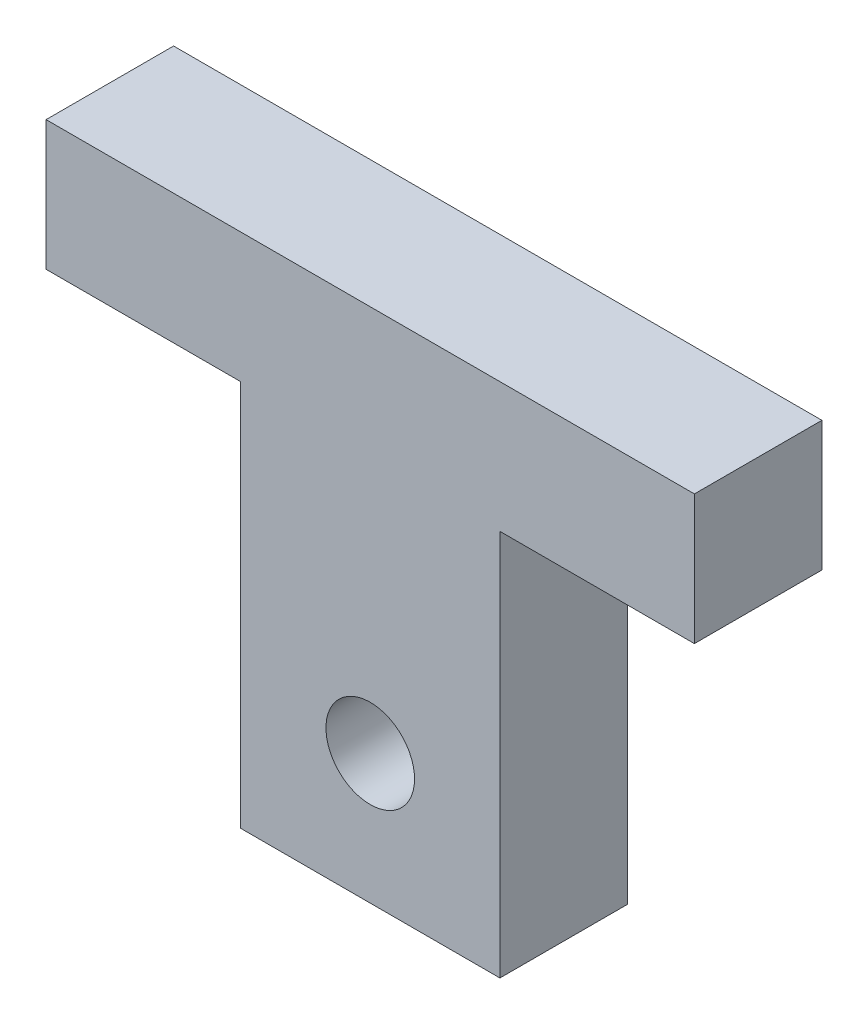
ISO-10303-21;
HEADER;
FILE_DESCRIPTION(('STEP AP214'),'2;1');
FILE_NAME('part.step','',(''),(''),'','','');
FILE_SCHEMA(('AUTOMOTIVE_DESIGN { 1 0 10303 214 1 1 1 1 }'));
ENDSEC;
DATA;
#1=APPLICATION_CONTEXT('core data for automotive mechanical design processes');
#2=APPLICATION_PROTOCOL_DEFINITION('international standard','automotive_design',2000,#1);
#3=PRODUCT_CONTEXT('',#1,'mechanical');
#4=PRODUCT('Part','Part','',(#3));
#5=PRODUCT_RELATED_PRODUCT_CATEGORY('part','',(#4));
#6=PRODUCT_DEFINITION_FORMATION('','',#4);
#7=PRODUCT_DEFINITION_CONTEXT('part definition',#1,'design');
#8=PRODUCT_DEFINITION('design','',#6,#7);
#9=PRODUCT_DEFINITION_SHAPE('','',#8);
#10=(LENGTH_UNIT() NAMED_UNIT(*) SI_UNIT(.MILLI.,.METRE.));
#11=(NAMED_UNIT(*) PLANE_ANGLE_UNIT() SI_UNIT($,.RADIAN.));
#12=(NAMED_UNIT(*) SI_UNIT($,.STERADIAN.) SOLID_ANGLE_UNIT());
#13=UNCERTAINTY_MEASURE_WITH_UNIT(LENGTH_MEASURE(1.E-05),#10,'distance_accuracy_value','');
#14=(GEOMETRIC_REPRESENTATION_CONTEXT(3) GLOBAL_UNCERTAINTY_ASSIGNED_CONTEXT((#13)) GLOBAL_UNIT_ASSIGNED_CONTEXT((#10,
#11,#12)) REPRESENTATION_CONTEXT('',''));
#15=CARTESIAN_POINT('',(0.,0.,0.));
#16=DIRECTION('',(0.,0.,1.));
#17=DIRECTION('',(1.,0.,0.));
#18=AXIS2_PLACEMENT_3D('',#15,#16,#17);
#19=CARTESIAN_POINT('',(0.,0.,5.9));
#20=DIRECTION('',(0.,0.,-1.));
#21=DIRECTION('',(-1.,0.,0.));
#22=AXIS2_PLACEMENT_3D('',#19,#20,#21);
#23=PLANE('',#22);
#24=DIRECTION('',(0.,1.,0.));
#25=VECTOR('',#24,1.);
#26=CARTESIAN_POINT('',(15.,-3.,5.9));
#27=LINE('',#26,#25);
#28=CARTESIAN_POINT('',(15.,-3.,5.9));
#29=VERTEX_POINT('',#28);
#30=CARTESIAN_POINT('',(15.,3.,5.9));
#31=VERTEX_POINT('',#30);
#32=EDGE_CURVE('E148',#29,#31,#27,.T.);
#33=ORIENTED_EDGE('',*,*,#32,.T.);
#34=DIRECTION('',(-1.,0.,0.));
#35=VECTOR('',#34,1.);
#36=CARTESIAN_POINT('',(-15.,3.,5.9));
#37=LINE('',#36,#35);
#38=CARTESIAN_POINT('',(-15.,3.,5.9));
#39=VERTEX_POINT('',#38);
#40=EDGE_CURVE('E96',#31,#39,#37,.T.);
#41=ORIENTED_EDGE('',*,*,#40,.T.);
#42=DIRECTION('',(0.,-1.,0.));
#43=VECTOR('',#42,1.);
#44=CARTESIAN_POINT('',(-15.,-3.,5.9));
#45=LINE('',#44,#43);
#46=CARTESIAN_POINT('',(-15.,-3.,5.9));
#47=VERTEX_POINT('',#46);
#48=EDGE_CURVE('E163',#39,#47,#45,.T.);
#49=ORIENTED_EDGE('',*,*,#48,.T.);
#50=DIRECTION('',(1.,0.,0.));
#51=VECTOR('',#50,1.);
#52=CARTESIAN_POINT('',(-15.,-3.,5.9));
#53=LINE('',#52,#51);
#54=CARTESIAN_POINT('',(-6.,-3.,5.9));
#55=VERTEX_POINT('',#54);
#56=EDGE_CURVE('E176',#47,#55,#53,.T.);
#57=ORIENTED_EDGE('',*,*,#56,.T.);
#58=DIRECTION('',(0.,-1.,0.));
#59=VECTOR('',#58,1.);
#60=CARTESIAN_POINT('',(-6.,-3.,5.9));
#61=LINE('',#60,#59);
#62=CARTESIAN_POINT('',(-6.,-20.9,5.9));
#63=VERTEX_POINT('',#62);
#64=EDGE_CURVE('E115',#55,#63,#61,.T.);
#65=ORIENTED_EDGE('',*,*,#64,.T.);
#66=DIRECTION('',(1.,0.,0.));
#67=VECTOR('',#66,1.);
#68=CARTESIAN_POINT('',(-6.,-20.9,5.9));
#69=LINE('',#68,#67);
#70=CARTESIAN_POINT('',(6.,-20.9,5.9));
#71=VERTEX_POINT('',#70);
#72=EDGE_CURVE('E109',#63,#71,#69,.T.);
#73=ORIENTED_EDGE('',*,*,#72,.T.);
#74=DIRECTION('',(0.,1.,0.));
#75=VECTOR('',#74,1.);
#76=CARTESIAN_POINT('',(6.,-20.9,5.9));
#77=LINE('',#76,#75);
#78=CARTESIAN_POINT('',(6.,-3.,5.9));
#79=VERTEX_POINT('',#78);
#80=EDGE_CURVE('E113',#71,#79,#77,.T.);
#81=ORIENTED_EDGE('',*,*,#80,.T.);
#82=DIRECTION('',(1.,0.,0.));
#83=VECTOR('',#82,1.);
#84=CARTESIAN_POINT('',(6.,-3.,5.9));
#85=LINE('',#84,#83);
#86=EDGE_CURVE('E53',#79,#29,#85,.T.);
#87=ORIENTED_EDGE('',*,*,#86,.T.);
#88=EDGE_LOOP('',(#33,#41,#49,#57,#65,#73,#81,#87));
#89=FACE_BOUND('',#88,.T.);
#90=CARTESIAN_POINT('',(0.,-14.9,5.9));
#91=DIRECTION('',(0.,0.,1.));
#92=DIRECTION('',(1.,0.,0.));
#93=AXIS2_PLACEMENT_3D('',#90,#91,#92);
#94=CIRCLE('',#93,2.05);
#95=CARTESIAN_POINT('',(2.05,-14.9,5.9));
#96=VERTEX_POINT('',#95);
#97=EDGE_CURVE('E137',#96,#96,#94,.T.);
#98=ORIENTED_EDGE('',*,*,#97,.F.);
#99=EDGE_LOOP('',(#98));
#100=FACE_BOUND('',#99,.T.);
#101=ADVANCED_FACE('F36',(#89,#100),#23,.F.);
#102=CARTESIAN_POINT('',(0.,0.,0.));
#103=DIRECTION('',(0.,0.,-1.));
#104=DIRECTION('',(-1.,0.,0.));
#105=AXIS2_PLACEMENT_3D('',#102,#103,#104);
#106=PLANE('',#105);
#107=DIRECTION('',(0.,1.,0.));
#108=VECTOR('',#107,1.);
#109=CARTESIAN_POINT('',(15.,-3.,0.));
#110=LINE('',#109,#108);
#111=CARTESIAN_POINT('',(15.,-3.,0.));
#112=VERTEX_POINT('',#111);
#113=CARTESIAN_POINT('',(15.,3.,0.));
#114=VERTEX_POINT('',#113);
#115=EDGE_CURVE('E133',#112,#114,#110,.T.);
#116=ORIENTED_EDGE('',*,*,#115,.F.);
#117=DIRECTION('',(1.,0.,0.));
#118=VECTOR('',#117,1.);
#119=CARTESIAN_POINT('',(6.,-3.,0.));
#120=LINE('',#119,#118);
#121=CARTESIAN_POINT('',(6.,-3.,0.));
#122=VERTEX_POINT('',#121);
#123=EDGE_CURVE('E88',#122,#112,#120,.T.);
#124=ORIENTED_EDGE('',*,*,#123,.F.);
#125=DIRECTION('',(0.,1.,0.));
#126=VECTOR('',#125,1.);
#127=CARTESIAN_POINT('',(6.,-20.9,0.));
#128=LINE('',#127,#126);
#129=CARTESIAN_POINT('',(6.,-20.9,0.));
#130=VERTEX_POINT('',#129);
#131=EDGE_CURVE('E82',#130,#122,#128,.T.);
#132=ORIENTED_EDGE('',*,*,#131,.F.);
#133=DIRECTION('',(1.,0.,0.));
#134=VECTOR('',#133,1.);
#135=CARTESIAN_POINT('',(-6.,-20.9,0.));
#136=LINE('',#135,#134);
#137=CARTESIAN_POINT('',(-6.,-20.9,0.));
#138=VERTEX_POINT('',#137);
#139=EDGE_CURVE('E123',#138,#130,#136,.T.);
#140=ORIENTED_EDGE('',*,*,#139,.F.);
#141=DIRECTION('',(0.,-1.,0.));
#142=VECTOR('',#141,1.);
#143=CARTESIAN_POINT('',(-6.,-3.,0.));
#144=LINE('',#143,#142);
#145=CARTESIAN_POINT('',(-6.,-3.,0.));
#146=VERTEX_POINT('',#145);
#147=EDGE_CURVE('E143',#146,#138,#144,.T.);
#148=ORIENTED_EDGE('',*,*,#147,.F.);
#149=DIRECTION('',(1.,0.,0.));
#150=VECTOR('',#149,1.);
#151=CARTESIAN_POINT('',(-15.,-3.,0.));
#152=LINE('',#151,#150);
#153=CARTESIAN_POINT('',(-15.,-3.,0.));
#154=VERTEX_POINT('',#153);
#155=EDGE_CURVE('E141',#154,#146,#152,.T.);
#156=ORIENTED_EDGE('',*,*,#155,.F.);
#157=DIRECTION('',(0.,-1.,0.));
#158=VECTOR('',#157,1.);
#159=CARTESIAN_POINT('',(-15.,-3.,0.));
#160=LINE('',#159,#158);
#161=CARTESIAN_POINT('',(-15.,3.,0.));
#162=VERTEX_POINT('',#161);
#163=EDGE_CURVE('E139',#162,#154,#160,.T.);
#164=ORIENTED_EDGE('',*,*,#163,.F.);
#165=DIRECTION('',(-1.,0.,0.));
#166=VECTOR('',#165,1.);
#167=CARTESIAN_POINT('',(-15.,3.,0.));
#168=LINE('',#167,#166);
#169=EDGE_CURVE('E136',#114,#162,#168,.T.);
#170=ORIENTED_EDGE('',*,*,#169,.F.);
#171=EDGE_LOOP('',(#116,#124,#132,#140,#148,#156,#164,#170));
#172=FACE_BOUND('',#171,.T.);
#173=CARTESIAN_POINT('',(0.,-14.9,0.));
#174=DIRECTION('',(0.,0.,1.));
#175=DIRECTION('',(1.,0.,0.));
#176=AXIS2_PLACEMENT_3D('',#173,#174,#175);
#177=CIRCLE('',#176,2.05);
#178=CARTESIAN_POINT('',(2.05,-14.9,0.));
#179=VERTEX_POINT('',#178);
#180=EDGE_CURVE('E182',#179,#179,#177,.T.);
#181=ORIENTED_EDGE('',*,*,#180,.T.);
#182=EDGE_LOOP('',(#181));
#183=FACE_BOUND('',#182,.T.);
#184=ADVANCED_FACE('F167',(#172,#183),#106,.T.);
#185=CARTESIAN_POINT('',(15.,-3.,5.9));
#186=DIRECTION('',(-1.,0.,0.));
#187=DIRECTION('',(0.,0.,1.));
#188=AXIS2_PLACEMENT_3D('',#185,#186,#187);
#189=PLANE('',#188);
#190=ORIENTED_EDGE('',*,*,#115,.T.);
#191=DIRECTION('',(0.,0.,-1.));
#192=VECTOR('',#191,1.);
#193=CARTESIAN_POINT('',(15.,3.,5.9));
#194=LINE('',#193,#192);
#195=EDGE_CURVE('E11',#31,#114,#194,.T.);
#196=ORIENTED_EDGE('',*,*,#195,.F.);
#197=ORIENTED_EDGE('',*,*,#32,.F.);
#198=DIRECTION('',(0.,0.,-1.));
#199=VECTOR('',#198,1.);
#200=CARTESIAN_POINT('',(15.,-3.,5.9));
#201=LINE('',#200,#199);
#202=EDGE_CURVE('E129',#29,#112,#201,.T.);
#203=ORIENTED_EDGE('',*,*,#202,.T.);
#204=EDGE_LOOP('',(#190,#196,#197,#203));
#205=FACE_BOUND('',#204,.T.);
#206=ADVANCED_FACE('F38',(#205),#189,.F.);
#207=CARTESIAN_POINT('',(-15.,3.,5.9));
#208=DIRECTION('',(0.,-1.,0.));
#209=DIRECTION('',(0.,0.,-1.));
#210=AXIS2_PLACEMENT_3D('',#207,#208,#209);
#211=PLANE('',#210);
#212=ORIENTED_EDGE('',*,*,#169,.T.);
#213=DIRECTION('',(0.,0.,-1.));
#214=VECTOR('',#213,1.);
#215=CARTESIAN_POINT('',(-15.,3.,5.9));
#216=LINE('',#215,#214);
#217=EDGE_CURVE('E45',#39,#162,#216,.T.);
#218=ORIENTED_EDGE('',*,*,#217,.F.);
#219=ORIENTED_EDGE('',*,*,#40,.F.);
#220=ORIENTED_EDGE('',*,*,#195,.T.);
#221=EDGE_LOOP('',(#212,#218,#219,#220));
#222=FACE_BOUND('',#221,.T.);
#223=ADVANCED_FACE('F210',(#222),#211,.F.);
#224=CARTESIAN_POINT('',(-15.,-3.,5.9));
#225=DIRECTION('',(1.,0.,0.));
#226=DIRECTION('',(0.,0.,-1.));
#227=AXIS2_PLACEMENT_3D('',#224,#225,#226);
#228=PLANE('',#227);
#229=ORIENTED_EDGE('',*,*,#163,.T.);
#230=DIRECTION('',(0.,0.,-1.));
#231=VECTOR('',#230,1.);
#232=CARTESIAN_POINT('',(-15.,-3.,5.9));
#233=LINE('',#232,#231);
#234=EDGE_CURVE('E155',#47,#154,#233,.T.);
#235=ORIENTED_EDGE('',*,*,#234,.F.);
#236=ORIENTED_EDGE('',*,*,#48,.F.);
#237=ORIENTED_EDGE('',*,*,#217,.T.);
#238=EDGE_LOOP('',(#229,#235,#236,#237));
#239=FACE_BOUND('',#238,.T.);
#240=ADVANCED_FACE('F161',(#239),#228,.F.);
#241=CARTESIAN_POINT('',(-15.,-3.,5.9));
#242=DIRECTION('',(0.,1.,0.));
#243=DIRECTION('',(-1.,0.,0.));
#244=AXIS2_PLACEMENT_3D('',#241,#242,#243);
#245=PLANE('',#244);
#246=ORIENTED_EDGE('',*,*,#155,.T.);
#247=DIRECTION('',(0.,0.,-1.));
#248=VECTOR('',#247,1.);
#249=CARTESIAN_POINT('',(-6.,-3.,5.9));
#250=LINE('',#249,#248);
#251=EDGE_CURVE('E152',#55,#146,#250,.T.);
#252=ORIENTED_EDGE('',*,*,#251,.F.);
#253=ORIENTED_EDGE('',*,*,#56,.F.);
#254=ORIENTED_EDGE('',*,*,#234,.T.);
#255=EDGE_LOOP('',(#246,#252,#253,#254));
#256=FACE_BOUND('',#255,.T.);
#257=ADVANCED_FACE('F172',(#256),#245,.F.);
#258=CARTESIAN_POINT('',(-6.,-3.,5.9));
#259=DIRECTION('',(1.,0.,0.));
#260=DIRECTION('',(0.,1.,0.));
#261=AXIS2_PLACEMENT_3D('',#258,#259,#260);
#262=PLANE('',#261);
#263=ORIENTED_EDGE('',*,*,#147,.T.);
#264=DIRECTION('',(0.,0.,-1.));
#265=VECTOR('',#264,1.);
#266=CARTESIAN_POINT('',(-6.,-20.9,5.9));
#267=LINE('',#266,#265);
#268=EDGE_CURVE('E124',#63,#138,#267,.T.);
#269=ORIENTED_EDGE('',*,*,#268,.F.);
#270=ORIENTED_EDGE('',*,*,#64,.F.);
#271=ORIENTED_EDGE('',*,*,#251,.T.);
#272=EDGE_LOOP('',(#263,#269,#270,#271));
#273=FACE_BOUND('',#272,.T.);
#274=ADVANCED_FACE('F175',(#273),#262,.F.);
#275=CARTESIAN_POINT('',(-6.,-20.9,5.9));
#276=DIRECTION('',(0.,1.,0.));
#277=DIRECTION('',(0.,0.,1.));
#278=AXIS2_PLACEMENT_3D('',#275,#276,#277);
#279=PLANE('',#278);
#280=ORIENTED_EDGE('',*,*,#139,.T.);
#281=DIRECTION('',(0.,0.,-1.));
#282=VECTOR('',#281,1.);
#283=CARTESIAN_POINT('',(6.,-20.9,5.9));
#284=LINE('',#283,#282);
#285=EDGE_CURVE('E120',#71,#130,#284,.T.);
#286=ORIENTED_EDGE('',*,*,#285,.F.);
#287=ORIENTED_EDGE('',*,*,#72,.F.);
#288=ORIENTED_EDGE('',*,*,#268,.T.);
#289=EDGE_LOOP('',(#280,#286,#287,#288));
#290=FACE_BOUND('',#289,.T.);
#291=ADVANCED_FACE('F121',(#290),#279,.F.);
#292=CARTESIAN_POINT('',(6.,-20.9,5.9));
#293=DIRECTION('',(-1.,0.,0.));
#294=DIRECTION('',(0.,-1.,0.));
#295=AXIS2_PLACEMENT_3D('',#292,#293,#294);
#296=PLANE('',#295);
#297=ORIENTED_EDGE('',*,*,#131,.T.);
#298=DIRECTION('',(0.,0.,-1.));
#299=VECTOR('',#298,1.);
#300=CARTESIAN_POINT('',(6.,-3.,5.9));
#301=LINE('',#300,#299);
#302=EDGE_CURVE('E125',#79,#122,#301,.T.);
#303=ORIENTED_EDGE('',*,*,#302,.F.);
#304=ORIENTED_EDGE('',*,*,#80,.F.);
#305=ORIENTED_EDGE('',*,*,#285,.T.);
#306=EDGE_LOOP('',(#297,#303,#304,#305));
#307=FACE_BOUND('',#306,.T.);
#308=ADVANCED_FACE('F127',(#307),#296,.F.);
#309=CARTESIAN_POINT('',(6.,-3.,5.9));
#310=DIRECTION('',(0.,1.,0.));
#311=DIRECTION('',(-1.,0.,0.));
#312=AXIS2_PLACEMENT_3D('',#309,#310,#311);
#313=PLANE('',#312);
#314=ORIENTED_EDGE('',*,*,#123,.T.);
#315=ORIENTED_EDGE('',*,*,#202,.F.);
#316=ORIENTED_EDGE('',*,*,#86,.F.);
#317=ORIENTED_EDGE('',*,*,#302,.T.);
#318=EDGE_LOOP('',(#314,#315,#316,#317));
#319=FACE_BOUND('',#318,.T.);
#320=ADVANCED_FACE('F198',(#319),#313,.F.);
#321=CARTESIAN_POINT('',(0.,-14.9,5.9));
#322=DIRECTION('',(0.,0.,-1.));
#323=DIRECTION('',(-1.,0.,0.));
#324=AXIS2_PLACEMENT_3D('',#321,#322,#323);
#325=CYLINDRICAL_SURFACE('',#324,2.05);
#326=ORIENTED_EDGE('',*,*,#97,.T.);
#327=EDGE_LOOP('',(#326));
#328=FACE_BOUND('',#327,.T.);
#329=ORIENTED_EDGE('',*,*,#180,.F.);
#330=EDGE_LOOP('',(#329));
#331=FACE_BOUND('',#330,.T.);
#332=ADVANCED_FACE('F188',(#328,#331),#325,.F.);
#333=CLOSED_SHELL('',(#101,#184,#206,#223,#240,#257,#274,#291,#308,#320,#332));
#334=MANIFOLD_SOLID_BREP('B2',#333);
#335=ADVANCED_BREP_SHAPE_REPRESENTATION('',(#18,#334),#14);
#336=SHAPE_DEFINITION_REPRESENTATION(#9,#335);
ENDSEC;
END-ISO-10303-21;
